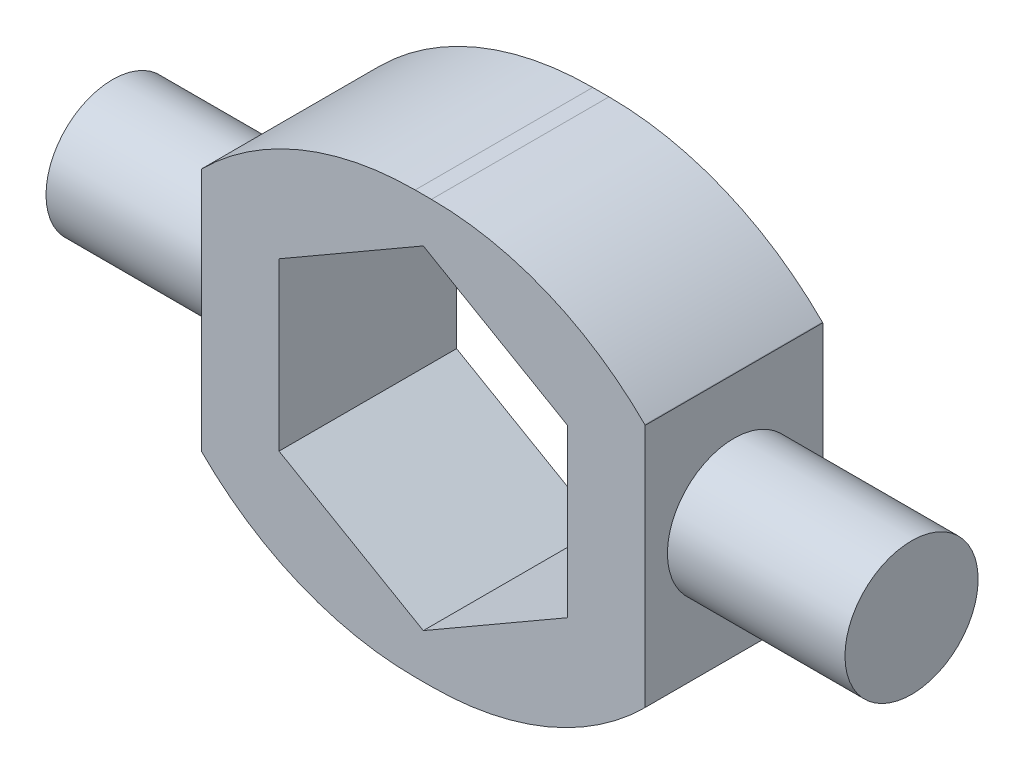
ISO-10303-21;
HEADER;
FILE_DESCRIPTION(('STEP AP214'),'2;1');
FILE_NAME('part.step','',(''),(''),'','','');
FILE_SCHEMA(('AUTOMOTIVE_DESIGN { 1 0 10303 214 1 1 1 1 }'));
ENDSEC;
DATA;
#1=APPLICATION_CONTEXT('core data for automotive mechanical design processes');
#2=APPLICATION_PROTOCOL_DEFINITION('international standard','automotive_design',2000,#1);
#3=PRODUCT_CONTEXT('',#1,'mechanical');
#4=PRODUCT('Part','Part','',(#3));
#5=PRODUCT_RELATED_PRODUCT_CATEGORY('part','',(#4));
#6=PRODUCT_DEFINITION_FORMATION('','',#4);
#7=PRODUCT_DEFINITION_CONTEXT('part definition',#1,'design');
#8=PRODUCT_DEFINITION('design','',#6,#7);
#9=PRODUCT_DEFINITION_SHAPE('','',#8);
#10=(LENGTH_UNIT() NAMED_UNIT(*) SI_UNIT(.MILLI.,.METRE.));
#11=(NAMED_UNIT(*) PLANE_ANGLE_UNIT() SI_UNIT($,.RADIAN.));
#12=(NAMED_UNIT(*) SI_UNIT($,.STERADIAN.) SOLID_ANGLE_UNIT());
#13=UNCERTAINTY_MEASURE_WITH_UNIT(LENGTH_MEASURE(1.E-05),#10,'distance_accuracy_value','');
#14=(GEOMETRIC_REPRESENTATION_CONTEXT(3) GLOBAL_UNCERTAINTY_ASSIGNED_CONTEXT((#13)) GLOBAL_UNIT_ASSIGNED_CONTEXT((#10,
#11,#12)) REPRESENTATION_CONTEXT('',''));
#15=CARTESIAN_POINT('',(0.,0.,0.));
#16=DIRECTION('',(0.,0.,1.));
#17=DIRECTION('',(1.,0.,0.));
#18=AXIS2_PLACEMENT_3D('',#15,#16,#17);
#19=CARTESIAN_POINT('',(0.,0.,25.4));
#20=DIRECTION('',(1.,0.,0.));
#21=DIRECTION('',(0.,0.,-1.));
#22=AXIS2_PLACEMENT_3D('',#19,#20,#21);
#23=PLANE('',#22);
#24=DIRECTION('',(0.,-1.,0.));
#25=VECTOR('',#24,1.);
#26=CARTESIAN_POINT('',(0.,0.,25.4));
#27=LINE('',#26,#25);
#28=CARTESIAN_POINT('',(0.,47.6602647216037,25.4));
#29=VERTEX_POINT('',#28);
#30=CARTESIAN_POINT('',(0.,12.7,25.4));
#31=VERTEX_POINT('',#30);
#32=EDGE_CURVE('E221',#29,#31,#27,.T.);
#33=ORIENTED_EDGE('',*,*,#32,.F.);
#34=DIRECTION('',(0.,0.,-1.));
#35=VECTOR('',#34,1.);
#36=CARTESIAN_POINT('',(0.,47.6602647216037,25.4));
#37=LINE('',#36,#35);
#38=CARTESIAN_POINT('',(0.,47.6602647216037,0.));
#39=VERTEX_POINT('',#38);
#40=EDGE_CURVE('E270',#29,#39,#37,.T.);
#41=ORIENTED_EDGE('',*,*,#40,.T.);
#42=DIRECTION('',(0.,-1.,0.));
#43=VECTOR('',#42,1.);
#44=CARTESIAN_POINT('',(0.,0.,0.));
#45=LINE('',#44,#43);
#46=CARTESIAN_POINT('',(0.,12.7,0.));
#47=VERTEX_POINT('',#46);
#48=EDGE_CURVE('E180',#39,#47,#45,.T.);
#49=ORIENTED_EDGE('',*,*,#48,.T.);
#50=DIRECTION('',(0.,0.,1.));
#51=VECTOR('',#50,1.);
#52=CARTESIAN_POINT('',(0.,12.7,25.4));
#53=LINE('',#52,#51);
#54=EDGE_CURVE('E268',#47,#31,#53,.T.);
#55=ORIENTED_EDGE('',*,*,#54,.T.);
#56=EDGE_LOOP('',(#33,#41,#49,#55));
#57=FACE_BOUND('',#56,.T.);
#58=CARTESIAN_POINT('',(0.,30.1801323608019,12.7));
#59=DIRECTION('',(1.,0.,0.));
#60=DIRECTION('',(0.,0.,-1.));
#61=AXIS2_PLACEMENT_3D('',#58,#59,#60);
#62=CIRCLE('',#61,9.525);
#63=CARTESIAN_POINT('',(0.,30.1801323608019,3.175));
#64=VERTEX_POINT('',#63);
#65=EDGE_CURVE('E273',#64,#64,#62,.F.);
#66=ORIENTED_EDGE('',*,*,#65,.F.);
#67=EDGE_LOOP('',(#66));
#68=FACE_BOUND('',#67,.T.);
#69=ADVANCED_FACE('F37',(#57,#68),#23,.F.);
#70=CARTESIAN_POINT('',(0.,0.,25.4));
#71=DIRECTION('',(0.,0.,-1.));
#72=DIRECTION('',(-1.,0.,0.));
#73=AXIS2_PLACEMENT_3D('',#70,#71,#72);
#74=PLANE('',#73);
#75=DIRECTION('',(0.707106781186546,-0.707106781186549,0.));
#76=VECTOR('',#75,1.);
#77=CARTESIAN_POINT('',(50.8,60.3602647216037,25.4));
#78=LINE('',#77,#76);
#79=CARTESIAN_POINT('',(63.5,47.6602647216036,25.4));
#80=VERTEX_POINT('',#79);
#81=CARTESIAN_POINT('',(63.4471291883649,47.7131355332388,25.4));
#82=VERTEX_POINT('',#81);
#83=EDGE_CURVE('E265',#80,#82,#78,.F.);
#84=ORIENTED_EDGE('',*,*,#83,.T.);
#85=CARTESIAN_POINT('',(32.9142583767297,17.1802647216037,25.4));
#86=DIRECTION('',(0.,0.,-1.));
#87=DIRECTION('',(-1.,0.,0.));
#88=AXIS2_PLACEMENT_3D('',#85,#86,#87);
#89=CIRCLE('',#88,43.18);
#90=CARTESIAN_POINT('',(32.9142583767297,60.3602647216037,25.4));
#91=VERTEX_POINT('',#90);
#92=EDGE_CURVE('E297',#82,#91,#89,.F.);
#93=ORIENTED_EDGE('',*,*,#92,.T.);
#94=DIRECTION('',(-1.,0.,0.));
#95=VECTOR('',#94,1.);
#96=CARTESIAN_POINT('',(0.,60.3602647216037,25.4));
#97=LINE('',#96,#95);
#98=CARTESIAN_POINT('',(30.5857416232703,60.3602647216037,25.4));
#99=VERTEX_POINT('',#98);
#100=EDGE_CURVE('E230',#91,#99,#97,.T.);
#101=ORIENTED_EDGE('',*,*,#100,.T.);
#102=CARTESIAN_POINT('',(30.5857416232703,17.1802647216037,25.4));
#103=DIRECTION('',(0.,0.,-1.));
#104=DIRECTION('',(-1.,0.,0.));
#105=AXIS2_PLACEMENT_3D('',#102,#103,#104);
#106=CIRCLE('',#105,43.18);
#107=CARTESIAN_POINT('',(0.0528708116351724,47.7131355332389,25.4));
#108=VERTEX_POINT('',#107);
#109=EDGE_CURVE('E295',#99,#108,#106,.F.);
#110=ORIENTED_EDGE('',*,*,#109,.T.);
#111=DIRECTION('',(0.707106781186548,0.707106781186547,0.));
#112=VECTOR('',#111,1.);
#113=CARTESIAN_POINT('',(0.,47.6602647216037,25.4));
#114=LINE('',#113,#112);
#115=EDGE_CURVE('E261',#108,#29,#114,.F.);
#116=ORIENTED_EDGE('',*,*,#115,.T.);
#117=ORIENTED_EDGE('',*,*,#32,.T.);
#118=DIRECTION('',(-0.707106781186546,0.707106781186549,0.));
#119=VECTOR('',#118,1.);
#120=CARTESIAN_POINT('',(12.7,0.,25.4));
#121=LINE('',#120,#119);
#122=CARTESIAN_POINT('',(0.0528708116350959,12.6471291883649,25.4));
#123=VERTEX_POINT('',#122);
#124=EDGE_CURVE('E258',#31,#123,#121,.F.);
#125=ORIENTED_EDGE('',*,*,#124,.T.);
#126=CARTESIAN_POINT('',(30.5857416232703,43.18,25.4));
#127=DIRECTION('',(0.,0.,-1.));
#128=DIRECTION('',(-1.,0.,0.));
#129=AXIS2_PLACEMENT_3D('',#126,#127,#128);
#130=CIRCLE('',#129,43.18);
#131=CARTESIAN_POINT('',(30.5857416232703,0.,25.4));
#132=VERTEX_POINT('',#131);
#133=EDGE_CURVE('E292',#123,#132,#130,.F.);
#134=ORIENTED_EDGE('',*,*,#133,.T.);
#135=DIRECTION('',(1.,0.,0.));
#136=VECTOR('',#135,1.);
#137=CARTESIAN_POINT('',(0.,0.,25.4));
#138=LINE('',#137,#136);
#139=CARTESIAN_POINT('',(32.9142583767298,0.,25.4));
#140=VERTEX_POINT('',#139);
#141=EDGE_CURVE('E224',#132,#140,#138,.T.);
#142=ORIENTED_EDGE('',*,*,#141,.T.);
#143=CARTESIAN_POINT('',(32.9142583767298,43.18,25.4));
#144=DIRECTION('',(0.,0.,-1.));
#145=DIRECTION('',(-1.,0.,0.));
#146=AXIS2_PLACEMENT_3D('',#143,#144,#145);
#147=CIRCLE('',#146,43.18);
#148=CARTESIAN_POINT('',(63.4471291883649,12.6471291883648,25.4));
#149=VERTEX_POINT('',#148);
#150=EDGE_CURVE('E52',#140,#149,#147,.F.);
#151=ORIENTED_EDGE('',*,*,#150,.T.);
#152=DIRECTION('',(-0.707106781186549,-0.707106781186546,0.));
#153=VECTOR('',#152,1.);
#154=CARTESIAN_POINT('',(63.5,12.7,25.4));
#155=LINE('',#154,#153);
#156=CARTESIAN_POINT('',(63.5,12.7,25.4));
#157=VERTEX_POINT('',#156);
#158=EDGE_CURVE('E263',#149,#157,#155,.F.);
#159=ORIENTED_EDGE('',*,*,#158,.T.);
#160=DIRECTION('',(0.,1.,0.));
#161=VECTOR('',#160,1.);
#162=CARTESIAN_POINT('',(63.5,0.,25.4));
#163=LINE('',#162,#161);
#164=EDGE_CURVE('E227',#157,#80,#163,.T.);
#165=ORIENTED_EDGE('',*,*,#164,.T.);
#166=EDGE_LOOP('',(#84,#93,#101,#110,#116,#117,#125,#134,#142,#151,#159,#165));
#167=FACE_BOUND('',#166,.T.);
#168=DIRECTION('',(-0.866025403784439,-0.5,0.));
#169=VECTOR('',#168,1.);
#170=CARTESIAN_POINT('',(31.75,54.0102647216037,25.4));
#171=LINE('',#170,#169);
#172=CARTESIAN_POINT('',(31.75,54.0102647216037,25.4));
#173=VERTEX_POINT('',#172);
#174=CARTESIAN_POINT('',(11.1125,42.0951985412028,25.4));
#175=VERTEX_POINT('',#174);
#176=EDGE_CURVE('E162',#173,#175,#171,.T.);
#177=ORIENTED_EDGE('',*,*,#176,.F.);
#178=DIRECTION('',(-0.866025403784438,0.5,0.));
#179=VECTOR('',#178,1.);
#180=CARTESIAN_POINT('',(52.3875,42.0951985412028,25.4));
#181=LINE('',#180,#179);
#182=CARTESIAN_POINT('',(52.3875,42.0951985412028,25.4));
#183=VERTEX_POINT('',#182);
#184=EDGE_CURVE('E196',#183,#173,#181,.T.);
#185=ORIENTED_EDGE('',*,*,#184,.F.);
#186=DIRECTION('',(0.,1.,0.));
#187=VECTOR('',#186,1.);
#188=CARTESIAN_POINT('',(52.3875,18.2650661804009,25.4));
#189=LINE('',#188,#187);
#190=CARTESIAN_POINT('',(52.3875,18.2650661804009,25.4));
#191=VERTEX_POINT('',#190);
#192=EDGE_CURVE('E193',#191,#183,#189,.T.);
#193=ORIENTED_EDGE('',*,*,#192,.F.);
#194=DIRECTION('',(0.866025403784438,0.5,0.));
#195=VECTOR('',#194,1.);
#196=CARTESIAN_POINT('',(31.75,6.35,25.4));
#197=LINE('',#196,#195);
#198=CARTESIAN_POINT('',(31.75,6.35,25.4));
#199=VERTEX_POINT('',#198);
#200=EDGE_CURVE('E188',#199,#191,#197,.T.);
#201=ORIENTED_EDGE('',*,*,#200,.F.);
#202=DIRECTION('',(0.866025403784439,-0.5,0.));
#203=VECTOR('',#202,1.);
#204=CARTESIAN_POINT('',(11.1125,18.2650661804009,25.4));
#205=LINE('',#204,#203);
#206=CARTESIAN_POINT('',(11.1125,18.2650661804009,25.4));
#207=VERTEX_POINT('',#206);
#208=EDGE_CURVE('E186',#207,#199,#205,.T.);
#209=ORIENTED_EDGE('',*,*,#208,.F.);
#210=DIRECTION('',(0.,-1.,0.));
#211=VECTOR('',#210,1.);
#212=CARTESIAN_POINT('',(11.1125,42.0951985412028,25.4));
#213=LINE('',#212,#211);
#214=EDGE_CURVE('E172',#175,#207,#213,.T.);
#215=ORIENTED_EDGE('',*,*,#214,.F.);
#216=EDGE_LOOP('',(#177,#185,#193,#201,#209,#215));
#217=FACE_BOUND('',#216,.T.);
#218=ADVANCED_FACE('F184',(#167,#217),#74,.F.);
#219=CARTESIAN_POINT('',(0.,0.,0.));
#220=DIRECTION('',(0.,0.,-1.));
#221=DIRECTION('',(-1.,0.,0.));
#222=AXIS2_PLACEMENT_3D('',#219,#220,#221);
#223=PLANE('',#222);
#224=DIRECTION('',(-1.,0.,0.));
#225=VECTOR('',#224,1.);
#226=CARTESIAN_POINT('',(0.,60.3602647216037,0.));
#227=LINE('',#226,#225);
#228=CARTESIAN_POINT('',(32.9142583767297,60.3602647216037,0.));
#229=VERTEX_POINT('',#228);
#230=CARTESIAN_POINT('',(30.5857416232703,60.3602647216037,0.));
#231=VERTEX_POINT('',#230);
#232=EDGE_CURVE('E225',#229,#231,#227,.T.);
#233=ORIENTED_EDGE('',*,*,#232,.F.);
#234=CARTESIAN_POINT('',(32.9142583767297,17.1802647216037,0.));
#235=DIRECTION('',(0.,0.,-1.));
#236=DIRECTION('',(-1.,0.,0.));
#237=AXIS2_PLACEMENT_3D('',#234,#235,#236);
#238=CIRCLE('',#237,43.18);
#239=CARTESIAN_POINT('',(63.4471291883649,47.7131355332388,0.));
#240=VERTEX_POINT('',#239);
#241=EDGE_CURVE('E288',#229,#240,#238,.T.);
#242=ORIENTED_EDGE('',*,*,#241,.T.);
#243=DIRECTION('',(-0.707106781186546,0.707106781186549,0.));
#244=VECTOR('',#243,1.);
#245=CARTESIAN_POINT('',(55.5801323608019,55.5801323608018,0.));
#246=LINE('',#245,#244);
#247=CARTESIAN_POINT('',(63.5,47.6602647216036,0.));
#248=VERTEX_POINT('',#247);
#249=EDGE_CURVE('E251',#240,#248,#246,.F.);
#250=ORIENTED_EDGE('',*,*,#249,.T.);
#251=DIRECTION('',(0.,1.,0.));
#252=VECTOR('',#251,1.);
#253=CARTESIAN_POINT('',(63.5,0.,0.));
#254=LINE('',#253,#252);
#255=CARTESIAN_POINT('',(63.5000000000001,12.7,0.));
#256=VERTEX_POINT('',#255);
#257=EDGE_CURVE('E239',#256,#248,#254,.T.);
#258=ORIENTED_EDGE('',*,*,#257,.F.);
#259=DIRECTION('',(0.707106781186549,0.707106781186546,0.));
#260=VECTOR('',#259,1.);
#261=CARTESIAN_POINT('',(25.3999999999999,-25.4,0.));
#262=LINE('',#261,#260);
#263=CARTESIAN_POINT('',(63.4471291883649,12.6471291883648,0.));
#264=VERTEX_POINT('',#263);
#265=EDGE_CURVE('E248',#256,#264,#262,.F.);
#266=ORIENTED_EDGE('',*,*,#265,.T.);
#267=CARTESIAN_POINT('',(32.9142583767298,43.18,0.));
#268=DIRECTION('',(0.,0.,-1.));
#269=DIRECTION('',(-1.,0.,0.));
#270=AXIS2_PLACEMENT_3D('',#267,#268,#269);
#271=CIRCLE('',#270,43.18);
#272=CARTESIAN_POINT('',(32.9142583767298,0.,0.));
#273=VERTEX_POINT('',#272);
#274=EDGE_CURVE('E284',#264,#273,#271,.T.);
#275=ORIENTED_EDGE('',*,*,#274,.T.);
#276=DIRECTION('',(1.,0.,0.));
#277=VECTOR('',#276,1.);
#278=CARTESIAN_POINT('',(0.,0.,0.));
#279=LINE('',#278,#277);
#280=CARTESIAN_POINT('',(30.5857416232703,0.,0.));
#281=VERTEX_POINT('',#280);
#282=EDGE_CURVE('E236',#281,#273,#279,.T.);
#283=ORIENTED_EDGE('',*,*,#282,.F.);
#284=CARTESIAN_POINT('',(30.5857416232703,43.18,0.));
#285=DIRECTION('',(0.,0.,-1.));
#286=DIRECTION('',(-1.,0.,0.));
#287=AXIS2_PLACEMENT_3D('',#284,#285,#286);
#288=CIRCLE('',#287,43.18);
#289=CARTESIAN_POINT('',(0.0528708116350977,12.6471291883649,0.));
#290=VERTEX_POINT('',#289);
#291=EDGE_CURVE('E282',#281,#290,#288,.T.);
#292=ORIENTED_EDGE('',*,*,#291,.T.);
#293=DIRECTION('',(0.707106781186546,-0.707106781186549,0.));
#294=VECTOR('',#293,1.);
#295=CARTESIAN_POINT('',(6.35000000000002,6.34999999999999,0.));
#296=LINE('',#295,#294);
#297=EDGE_CURVE('E233',#290,#47,#296,.F.);
#298=ORIENTED_EDGE('',*,*,#297,.T.);
#299=ORIENTED_EDGE('',*,*,#48,.F.);
#300=DIRECTION('',(-0.707106781186548,-0.707106781186547,0.));
#301=VECTOR('',#300,1.);
#302=CARTESIAN_POINT('',(-23.8301323608018,23.8301323608019,0.));
#303=LINE('',#302,#301);
#304=CARTESIAN_POINT('',(0.0528708116351792,47.7131355332389,0.));
#305=VERTEX_POINT('',#304);
#306=EDGE_CURVE('E245',#39,#305,#303,.F.);
#307=ORIENTED_EDGE('',*,*,#306,.T.);
#308=CARTESIAN_POINT('',(30.5857416232703,17.1802647216037,0.));
#309=DIRECTION('',(0.,0.,-1.));
#310=DIRECTION('',(-1.,0.,0.));
#311=AXIS2_PLACEMENT_3D('',#308,#309,#310);
#312=CIRCLE('',#311,43.18);
#313=EDGE_CURVE('E286',#305,#231,#312,.T.);
#314=ORIENTED_EDGE('',*,*,#313,.T.);
#315=EDGE_LOOP('',(#233,#242,#250,#258,#266,#275,#283,#292,#298,#299,#307,#314));
#316=FACE_BOUND('',#315,.T.);
#317=DIRECTION('',(-0.866025403784438,0.5,0.));
#318=VECTOR('',#317,1.);
#319=CARTESIAN_POINT('',(52.3875,42.0951985412028,0.));
#320=LINE('',#319,#318);
#321=CARTESIAN_POINT('',(52.3875,42.0951985412028,0.));
#322=VERTEX_POINT('',#321);
#323=CARTESIAN_POINT('',(31.75,54.0102647216037,0.));
#324=VERTEX_POINT('',#323);
#325=EDGE_CURVE('E173',#322,#324,#320,.T.);
#326=ORIENTED_EDGE('',*,*,#325,.T.);
#327=DIRECTION('',(-0.866025403784439,-0.5,0.));
#328=VECTOR('',#327,1.);
#329=CARTESIAN_POINT('',(31.75,54.0102647216037,0.));
#330=LINE('',#329,#328);
#331=CARTESIAN_POINT('',(11.1125,42.0951985412028,0.));
#332=VERTEX_POINT('',#331);
#333=EDGE_CURVE('E198',#324,#332,#330,.T.);
#334=ORIENTED_EDGE('',*,*,#333,.T.);
#335=DIRECTION('',(0.,-1.,0.));
#336=VECTOR('',#335,1.);
#337=CARTESIAN_POINT('',(11.1125,42.0951985412028,0.));
#338=LINE('',#337,#336);
#339=CARTESIAN_POINT('',(11.1125,18.2650661804009,0.));
#340=VERTEX_POINT('',#339);
#341=EDGE_CURVE('E179',#332,#340,#338,.T.);
#342=ORIENTED_EDGE('',*,*,#341,.T.);
#343=DIRECTION('',(0.866025403784439,-0.5,0.));
#344=VECTOR('',#343,1.);
#345=CARTESIAN_POINT('',(11.1125,18.2650661804009,0.));
#346=LINE('',#345,#344);
#347=CARTESIAN_POINT('',(31.75,6.35,0.));
#348=VERTEX_POINT('',#347);
#349=EDGE_CURVE('E202',#340,#348,#346,.T.);
#350=ORIENTED_EDGE('',*,*,#349,.T.);
#351=DIRECTION('',(0.866025403784438,0.5,0.));
#352=VECTOR('',#351,1.);
#353=CARTESIAN_POINT('',(31.75,6.35,0.));
#354=LINE('',#353,#352);
#355=CARTESIAN_POINT('',(52.3875,18.2650661804009,0.));
#356=VERTEX_POINT('',#355);
#357=EDGE_CURVE('E205',#348,#356,#354,.T.);
#358=ORIENTED_EDGE('',*,*,#357,.T.);
#359=DIRECTION('',(0.,1.,0.));
#360=VECTOR('',#359,1.);
#361=CARTESIAN_POINT('',(52.3875,18.2650661804009,0.));
#362=LINE('',#361,#360);
#363=EDGE_CURVE('E208',#356,#322,#362,.T.);
#364=ORIENTED_EDGE('',*,*,#363,.T.);
#365=EDGE_LOOP('',(#326,#334,#342,#350,#358,#364));
#366=FACE_BOUND('',#365,.T.);
#367=ADVANCED_FACE('F312',(#316,#366),#223,.T.);
#368=CARTESIAN_POINT('',(0.,0.,25.4));
#369=DIRECTION('',(0.,1.,0.));
#370=DIRECTION('',(-1.,0.,0.));
#371=AXIS2_PLACEMENT_3D('',#368,#369,#370);
#372=PLANE('',#371);
#373=ORIENTED_EDGE('',*,*,#282,.T.);
#374=DIRECTION('',(0.,0.,-1.));
#375=VECTOR('',#374,1.);
#376=CARTESIAN_POINT('',(32.9142583767298,0.,25.4));
#377=LINE('',#376,#375);
#378=EDGE_CURVE('E304',#273,#140,#377,.F.);
#379=ORIENTED_EDGE('',*,*,#378,.T.);
#380=ORIENTED_EDGE('',*,*,#141,.F.);
#381=DIRECTION('',(0.,0.,1.));
#382=VECTOR('',#381,1.);
#383=CARTESIAN_POINT('',(30.5857416232703,0.,0.));
#384=LINE('',#383,#382);
#385=EDGE_CURVE('E301',#132,#281,#384,.F.);
#386=ORIENTED_EDGE('',*,*,#385,.T.);
#387=EDGE_LOOP('',(#373,#379,#380,#386));
#388=FACE_BOUND('',#387,.T.);
#389=ADVANCED_FACE('F318',(#388),#372,.F.);
#390=CARTESIAN_POINT('',(63.5,0.,25.4));
#391=DIRECTION('',(-1.,0.,0.));
#392=DIRECTION('',(0.,0.,1.));
#393=AXIS2_PLACEMENT_3D('',#390,#391,#392);
#394=PLANE('',#393);
#395=CARTESIAN_POINT('',(63.5000000000001,30.1801323608019,12.7));
#396=DIRECTION('',(-1.,0.,0.));
#397=DIRECTION('',(0.,0.,1.));
#398=AXIS2_PLACEMENT_3D('',#395,#396,#397);
#399=CIRCLE('',#398,9.525);
#400=CARTESIAN_POINT('',(63.5000000000001,30.1801323608019,22.225));
#401=VERTEX_POINT('',#400);
#402=EDGE_CURVE('E578',#401,#401,#399,.T.);
#403=ORIENTED_EDGE('',*,*,#402,.T.);
#404=EDGE_LOOP('',(#403));
#405=FACE_BOUND('',#404,.T.);
#406=ORIENTED_EDGE('',*,*,#257,.T.);
#407=DIRECTION('',(0.,0.,1.));
#408=VECTOR('',#407,1.);
#409=CARTESIAN_POINT('',(63.5,47.6602647216036,25.4));
#410=LINE('',#409,#408);
#411=EDGE_CURVE('E256',#248,#80,#410,.T.);
#412=ORIENTED_EDGE('',*,*,#411,.T.);
#413=ORIENTED_EDGE('',*,*,#164,.F.);
#414=DIRECTION('',(0.,0.,-1.));
#415=VECTOR('',#414,1.);
#416=CARTESIAN_POINT('',(63.5,12.7,25.4));
#417=LINE('',#416,#415);
#418=EDGE_CURVE('E253',#157,#256,#417,.T.);
#419=ORIENTED_EDGE('',*,*,#418,.T.);
#420=EDGE_LOOP('',(#406,#412,#413,#419));
#421=FACE_BOUND('',#420,.T.);
#422=ADVANCED_FACE('F356',(#405,#421),#394,.F.);
#423=CARTESIAN_POINT('',(0.,60.3602647216037,25.4));
#424=DIRECTION('',(0.,-1.,0.));
#425=DIRECTION('',(0.,0.,-1.));
#426=AXIS2_PLACEMENT_3D('',#423,#424,#425);
#427=PLANE('',#426);
#428=ORIENTED_EDGE('',*,*,#100,.F.);
#429=DIRECTION('',(0.,0.,1.));
#430=VECTOR('',#429,1.);
#431=CARTESIAN_POINT('',(32.9142583767297,60.3602647216037,0.));
#432=LINE('',#431,#430);
#433=EDGE_CURVE('E279',#91,#229,#432,.F.);
#434=ORIENTED_EDGE('',*,*,#433,.T.);
#435=ORIENTED_EDGE('',*,*,#232,.T.);
#436=DIRECTION('',(0.,0.,-1.));
#437=VECTOR('',#436,1.);
#438=CARTESIAN_POINT('',(30.5857416232703,60.3602647216037,25.4));
#439=LINE('',#438,#437);
#440=EDGE_CURVE('E276',#231,#99,#439,.F.);
#441=ORIENTED_EDGE('',*,*,#440,.T.);
#442=EDGE_LOOP('',(#428,#434,#435,#441));
#443=FACE_BOUND('',#442,.T.);
#444=ADVANCED_FACE('F343',(#443),#427,.F.);
#445=CARTESIAN_POINT('',(31.75,54.0102647216037,25.4));
#446=DIRECTION('',(0.5,-0.866025403784439,0.));
#447=DIRECTION('',(0.866025403784439,0.5,0.));
#448=AXIS2_PLACEMENT_3D('',#445,#446,#447);
#449=PLANE('',#448);
#450=ORIENTED_EDGE('',*,*,#333,.F.);
#451=DIRECTION('',(0.,0.,-1.));
#452=VECTOR('',#451,1.);
#453=CARTESIAN_POINT('',(31.75,54.0102647216037,25.4));
#454=LINE('',#453,#452);
#455=EDGE_CURVE('E168',#173,#324,#454,.T.);
#456=ORIENTED_EDGE('',*,*,#455,.F.);
#457=ORIENTED_EDGE('',*,*,#176,.T.);
#458=DIRECTION('',(0.,0.,-1.));
#459=VECTOR('',#458,1.);
#460=CARTESIAN_POINT('',(11.1125,42.0951985412028,25.4));
#461=LINE('',#460,#459);
#462=EDGE_CURVE('E165',#175,#332,#461,.T.);
#463=ORIENTED_EDGE('',*,*,#462,.T.);
#464=EDGE_LOOP('',(#450,#456,#457,#463));
#465=FACE_BOUND('',#464,.T.);
#466=ADVANCED_FACE('F164',(#465),#449,.T.);
#467=CARTESIAN_POINT('',(11.1125,42.0951985412028,25.4));
#468=DIRECTION('',(1.,0.,0.));
#469=DIRECTION('',(0.,1.,0.));
#470=AXIS2_PLACEMENT_3D('',#467,#468,#469);
#471=PLANE('',#470);
#472=ORIENTED_EDGE('',*,*,#341,.F.);
#473=ORIENTED_EDGE('',*,*,#462,.F.);
#474=ORIENTED_EDGE('',*,*,#214,.T.);
#475=DIRECTION('',(0.,0.,-1.));
#476=VECTOR('',#475,1.);
#477=CARTESIAN_POINT('',(11.1125,18.2650661804009,25.4));
#478=LINE('',#477,#476);
#479=EDGE_CURVE('E181',#207,#340,#478,.T.);
#480=ORIENTED_EDGE('',*,*,#479,.T.);
#481=EDGE_LOOP('',(#472,#473,#474,#480));
#482=FACE_BOUND('',#481,.T.);
#483=ADVANCED_FACE('F176',(#482),#471,.T.);
#484=CARTESIAN_POINT('',(11.1125,18.2650661804009,25.4));
#485=DIRECTION('',(0.5,0.866025403784439,0.));
#486=DIRECTION('',(-0.866025403784439,0.5,0.));
#487=AXIS2_PLACEMENT_3D('',#484,#485,#486);
#488=PLANE('',#487);
#489=ORIENTED_EDGE('',*,*,#349,.F.);
#490=ORIENTED_EDGE('',*,*,#479,.F.);
#491=ORIENTED_EDGE('',*,*,#208,.T.);
#492=DIRECTION('',(0.,0.,-1.));
#493=VECTOR('',#492,1.);
#494=CARTESIAN_POINT('',(31.75,6.35,25.4));
#495=LINE('',#494,#493);
#496=EDGE_CURVE('E218',#199,#348,#495,.T.);
#497=ORIENTED_EDGE('',*,*,#496,.T.);
#498=EDGE_LOOP('',(#489,#490,#491,#497));
#499=FACE_BOUND('',#498,.T.);
#500=ADVANCED_FACE('F523',(#499),#488,.T.);
#501=CARTESIAN_POINT('',(31.75,6.35,25.4));
#502=DIRECTION('',(-0.5,0.866025403784438,0.));
#503=DIRECTION('',(-0.866025403784438,-0.5,0.));
#504=AXIS2_PLACEMENT_3D('',#501,#502,#503);
#505=PLANE('',#504);
#506=ORIENTED_EDGE('',*,*,#357,.F.);
#507=ORIENTED_EDGE('',*,*,#496,.F.);
#508=ORIENTED_EDGE('',*,*,#200,.T.);
#509=DIRECTION('',(0.,0.,-1.));
#510=VECTOR('',#509,1.);
#511=CARTESIAN_POINT('',(52.3875,18.2650661804009,25.4));
#512=LINE('',#511,#510);
#513=EDGE_CURVE('E216',#191,#356,#512,.T.);
#514=ORIENTED_EDGE('',*,*,#513,.T.);
#515=EDGE_LOOP('',(#506,#507,#508,#514));
#516=FACE_BOUND('',#515,.T.);
#517=ADVANCED_FACE('F514',(#516),#505,.T.);
#518=CARTESIAN_POINT('',(52.3875,18.2650661804009,25.4));
#519=DIRECTION('',(-1.,0.,0.));
#520=DIRECTION('',(0.,0.,1.));
#521=AXIS2_PLACEMENT_3D('',#518,#519,#520);
#522=PLANE('',#521);
#523=ORIENTED_EDGE('',*,*,#363,.F.);
#524=ORIENTED_EDGE('',*,*,#513,.F.);
#525=ORIENTED_EDGE('',*,*,#192,.T.);
#526=DIRECTION('',(0.,0.,-1.));
#527=VECTOR('',#526,1.);
#528=CARTESIAN_POINT('',(52.3875,42.0951985412028,25.4));
#529=LINE('',#528,#527);
#530=EDGE_CURVE('E214',#183,#322,#529,.T.);
#531=ORIENTED_EDGE('',*,*,#530,.T.);
#532=EDGE_LOOP('',(#523,#524,#525,#531));
#533=FACE_BOUND('',#532,.T.);
#534=ADVANCED_FACE('F505',(#533),#522,.T.);
#535=CARTESIAN_POINT('',(52.3875,42.0951985412028,25.4));
#536=DIRECTION('',(-0.5,-0.866025403784438,0.));
#537=DIRECTION('',(0.866025403784438,-0.5,0.));
#538=AXIS2_PLACEMENT_3D('',#535,#536,#537);
#539=PLANE('',#538);
#540=ORIENTED_EDGE('',*,*,#325,.F.);
#541=ORIENTED_EDGE('',*,*,#530,.F.);
#542=ORIENTED_EDGE('',*,*,#184,.T.);
#543=ORIENTED_EDGE('',*,*,#455,.T.);
#544=EDGE_LOOP('',(#540,#541,#542,#543));
#545=FACE_BOUND('',#544,.T.);
#546=ADVANCED_FACE('F380',(#545),#539,.T.);
#547=CARTESIAN_POINT('',(50.8,60.3602647216037,25.4));
#548=DIRECTION('',(-0.707106781186549,-0.707106781186546,0.));
#549=DIRECTION('',(0.,0.,-1.));
#550=AXIS2_PLACEMENT_3D('',#547,#548,#549);
#551=PLANE('',#550);
#552=ORIENTED_EDGE('',*,*,#249,.F.);
#553=DIRECTION('',(0.,0.,-1.));
#554=VECTOR('',#553,1.);
#555=CARTESIAN_POINT('',(63.4471291883649,47.7131355332388,25.4));
#556=LINE('',#555,#554);
#557=EDGE_CURVE('E290',#240,#82,#556,.F.);
#558=ORIENTED_EDGE('',*,*,#557,.T.);
#559=ORIENTED_EDGE('',*,*,#83,.F.);
#560=ORIENTED_EDGE('',*,*,#411,.F.);
#561=EDGE_LOOP('',(#552,#558,#559,#560));
#562=FACE_BOUND('',#561,.T.);
#563=ADVANCED_FACE('F352',(#562),#551,.F.);
#564=CARTESIAN_POINT('',(63.5,12.7,25.4));
#565=DIRECTION('',(-0.707106781186546,0.707106781186549,0.));
#566=DIRECTION('',(0.,0.,-1.));
#567=AXIS2_PLACEMENT_3D('',#564,#565,#566);
#568=PLANE('',#567);
#569=ORIENTED_EDGE('',*,*,#158,.F.);
#570=DIRECTION('',(0.,0.,1.));
#571=VECTOR('',#570,1.);
#572=CARTESIAN_POINT('',(63.4471291883649,12.6471291883648,0.));
#573=LINE('',#572,#571);
#574=EDGE_CURVE('E45',#149,#264,#573,.F.);
#575=ORIENTED_EDGE('',*,*,#574,.T.);
#576=ORIENTED_EDGE('',*,*,#265,.F.);
#577=ORIENTED_EDGE('',*,*,#418,.F.);
#578=EDGE_LOOP('',(#569,#575,#576,#577));
#579=FACE_BOUND('',#578,.T.);
#580=ADVANCED_FACE('F306',(#579),#568,.F.);
#581=CARTESIAN_POINT('',(0.,47.6602647216037,25.4));
#582=DIRECTION('',(0.707106781186547,-0.707106781186548,0.));
#583=DIRECTION('',(0.,0.,-1.));
#584=AXIS2_PLACEMENT_3D('',#581,#582,#583);
#585=PLANE('',#584);
#586=ORIENTED_EDGE('',*,*,#115,.F.);
#587=DIRECTION('',(0.,0.,1.));
#588=VECTOR('',#587,1.);
#589=CARTESIAN_POINT('',(0.0528708116351723,47.7131355332389,0.));
#590=LINE('',#589,#588);
#591=EDGE_CURVE('E299',#108,#305,#590,.F.);
#592=ORIENTED_EDGE('',*,*,#591,.T.);
#593=ORIENTED_EDGE('',*,*,#306,.F.);
#594=ORIENTED_EDGE('',*,*,#40,.F.);
#595=EDGE_LOOP('',(#586,#592,#593,#594));
#596=FACE_BOUND('',#595,.T.);
#597=ADVANCED_FACE('F336',(#596),#585,.F.);
#598=CARTESIAN_POINT('',(12.7,0.,25.4));
#599=DIRECTION('',(0.707106781186549,0.707106781186546,0.));
#600=DIRECTION('',(0.,0.,-1.));
#601=AXIS2_PLACEMENT_3D('',#598,#599,#600);
#602=PLANE('',#601);
#603=ORIENTED_EDGE('',*,*,#297,.F.);
#604=DIRECTION('',(0.,0.,-1.));
#605=VECTOR('',#604,1.);
#606=CARTESIAN_POINT('',(0.0528708116351002,12.6471291883649,25.4));
#607=LINE('',#606,#605);
#608=EDGE_CURVE('E11',#290,#123,#607,.F.);
#609=ORIENTED_EDGE('',*,*,#608,.T.);
#610=ORIENTED_EDGE('',*,*,#124,.F.);
#611=ORIENTED_EDGE('',*,*,#54,.F.);
#612=EDGE_LOOP('',(#603,#609,#610,#611));
#613=FACE_BOUND('',#612,.T.);
#614=ADVANCED_FACE('F328',(#613),#602,.F.);
#615=CARTESIAN_POINT('',(-25.4,30.1801323608019,12.7));
#616=DIRECTION('',(1.,0.,0.));
#617=DIRECTION('',(0.,0.,-1.));
#618=AXIS2_PLACEMENT_3D('',#615,#616,#617);
#619=CYLINDRICAL_SURFACE('',#618,9.525);
#620=CARTESIAN_POINT('',(-25.4,30.1801323608019,12.7));
#621=DIRECTION('',(-1.,0.,0.));
#622=DIRECTION('',(0.,0.,1.));
#623=AXIS2_PLACEMENT_3D('',#620,#621,#622);
#624=CIRCLE('',#623,9.525);
#625=CARTESIAN_POINT('',(-25.4,30.1801323608019,22.225));
#626=VERTEX_POINT('',#625);
#627=EDGE_CURVE('E200',#626,#626,#624,.T.);
#628=ORIENTED_EDGE('',*,*,#627,.F.);
#629=EDGE_LOOP('',(#628));
#630=FACE_BOUND('',#629,.T.);
#631=ORIENTED_EDGE('',*,*,#65,.T.);
#632=EDGE_LOOP('',(#631));
#633=FACE_BOUND('',#632,.T.);
#634=ADVANCED_FACE('F387',(#630,#633),#619,.T.);
#635=CARTESIAN_POINT('',(-25.4,30.1801323608019,12.7));
#636=DIRECTION('',(-1.,0.,0.));
#637=DIRECTION('',(0.,0.,1.));
#638=AXIS2_PLACEMENT_3D('',#635,#636,#637);
#639=PLANE('',#638);
#640=ORIENTED_EDGE('',*,*,#627,.T.);
#641=EDGE_LOOP('',(#640));
#642=FACE_BOUND('',#641,.T.);
#643=ADVANCED_FACE('F468',(#642),#639,.T.);
#644=CARTESIAN_POINT('',(88.9000000000001,30.1801323608019,12.7));
#645=DIRECTION('',(-1.,0.,0.));
#646=DIRECTION('',(0.,0.,1.));
#647=AXIS2_PLACEMENT_3D('',#644,#645,#646);
#648=CYLINDRICAL_SURFACE('',#647,9.525);
#649=CARTESIAN_POINT('',(88.9000000000001,30.1801323608019,12.7));
#650=DIRECTION('',(-1.,0.,0.));
#651=DIRECTION('',(0.,0.,1.));
#652=AXIS2_PLACEMENT_3D('',#649,#650,#651);
#653=CIRCLE('',#652,9.525);
#654=CARTESIAN_POINT('',(88.9000000000001,30.1801323608019,22.225));
#655=VERTEX_POINT('',#654);
#656=EDGE_CURVE('E576',#655,#655,#653,.T.);
#657=ORIENTED_EDGE('',*,*,#656,.T.);
#658=EDGE_LOOP('',(#657));
#659=FACE_BOUND('',#658,.T.);
#660=ORIENTED_EDGE('',*,*,#402,.F.);
#661=EDGE_LOOP('',(#660));
#662=FACE_BOUND('',#661,.T.);
#663=ADVANCED_FACE('F459',(#659,#662),#648,.T.);
#664=CARTESIAN_POINT('',(88.9000000000001,30.1801323608019,12.7));
#665=DIRECTION('',(1.,0.,0.));
#666=DIRECTION('',(0.,0.,1.));
#667=AXIS2_PLACEMENT_3D('',#664,#665,#666);
#668=PLANE('',#667);
#669=ORIENTED_EDGE('',*,*,#656,.F.);
#670=EDGE_LOOP('',(#669));
#671=FACE_BOUND('',#670,.T.);
#672=ADVANCED_FACE('F390',(#671),#668,.T.);
#673=CARTESIAN_POINT('',(32.9142583767297,17.1802647216037,25.4));
#674=DIRECTION('',(0.,0.,-1.));
#675=DIRECTION('',(-1.,0.,0.));
#676=AXIS2_PLACEMENT_3D('',#673,#674,#675);
#677=CYLINDRICAL_SURFACE('',#676,43.18);
#678=ORIENTED_EDGE('',*,*,#92,.F.);
#679=ORIENTED_EDGE('',*,*,#557,.F.);
#680=ORIENTED_EDGE('',*,*,#241,.F.);
#681=ORIENTED_EDGE('',*,*,#433,.F.);
#682=EDGE_LOOP('',(#678,#679,#680,#681));
#683=FACE_BOUND('',#682,.T.);
#684=ADVANCED_FACE('F347',(#683),#677,.T.);
#685=CARTESIAN_POINT('',(30.5857416232703,17.1802647216037,25.4));
#686=DIRECTION('',(0.,0.,1.));
#687=DIRECTION('',(1.,0.,0.));
#688=AXIS2_PLACEMENT_3D('',#685,#686,#687);
#689=CYLINDRICAL_SURFACE('',#688,43.18);
#690=ORIENTED_EDGE('',*,*,#313,.F.);
#691=ORIENTED_EDGE('',*,*,#591,.F.);
#692=ORIENTED_EDGE('',*,*,#109,.F.);
#693=ORIENTED_EDGE('',*,*,#440,.F.);
#694=EDGE_LOOP('',(#690,#691,#692,#693));
#695=FACE_BOUND('',#694,.T.);
#696=ADVANCED_FACE('F339',(#695),#689,.T.);
#697=CARTESIAN_POINT('',(32.9142583767298,43.18,25.4));
#698=DIRECTION('',(0.,0.,1.));
#699=DIRECTION('',(1.,0.,0.));
#700=AXIS2_PLACEMENT_3D('',#697,#698,#699);
#701=CYLINDRICAL_SURFACE('',#700,43.18);
#702=ORIENTED_EDGE('',*,*,#274,.F.);
#703=ORIENTED_EDGE('',*,*,#574,.F.);
#704=ORIENTED_EDGE('',*,*,#150,.F.);
#705=ORIENTED_EDGE('',*,*,#378,.F.);
#706=EDGE_LOOP('',(#702,#703,#704,#705));
#707=FACE_BOUND('',#706,.T.);
#708=ADVANCED_FACE('F315',(#707),#701,.T.);
#709=CARTESIAN_POINT('',(30.5857416232703,43.18,25.4));
#710=DIRECTION('',(0.,0.,-1.));
#711=DIRECTION('',(-1.,0.,0.));
#712=AXIS2_PLACEMENT_3D('',#709,#710,#711);
#713=CYLINDRICAL_SURFACE('',#712,43.18);
#714=ORIENTED_EDGE('',*,*,#133,.F.);
#715=ORIENTED_EDGE('',*,*,#608,.F.);
#716=ORIENTED_EDGE('',*,*,#291,.F.);
#717=ORIENTED_EDGE('',*,*,#385,.F.);
#718=EDGE_LOOP('',(#714,#715,#716,#717));
#719=FACE_BOUND('',#718,.T.);
#720=ADVANCED_FACE('F39',(#719),#713,.T.);
#721=CLOSED_SHELL('',(#69,#218,#367,#389,#422,#444,#466,#483,#500,#517,#534,#546,#563,#580,#597,
#614,#634,#643,#663,#672,#684,#696,#708,#720));
#722=MANIFOLD_SOLID_BREP('B2',#721);
#723=ADVANCED_BREP_SHAPE_REPRESENTATION('',(#18,#722),#14);
#724=SHAPE_DEFINITION_REPRESENTATION(#9,#723);
ENDSEC;
END-ISO-10303-21;
